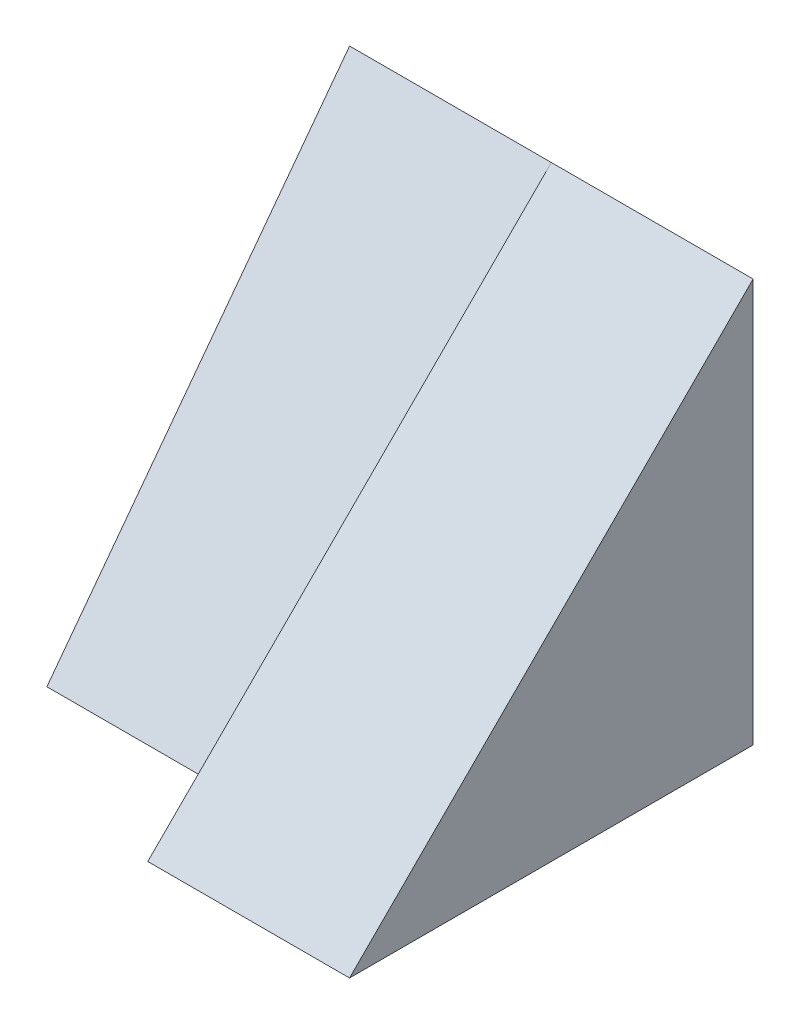
ISO-10303-21;
HEADER;
FILE_DESCRIPTION(('STEP AP214'),'2;1');
FILE_NAME('part.step','',(''),(''),'','','');
FILE_SCHEMA(('AUTOMOTIVE_DESIGN { 1 0 10303 214 1 1 1 1 }'));
ENDSEC;
DATA;
#1=APPLICATION_CONTEXT('core data for automotive mechanical design processes');
#2=APPLICATION_PROTOCOL_DEFINITION('international standard','automotive_design',2000,#1);
#3=PRODUCT_CONTEXT('',#1,'mechanical');
#4=PRODUCT('Part','Part','',(#3));
#5=PRODUCT_RELATED_PRODUCT_CATEGORY('part','',(#4));
#6=PRODUCT_DEFINITION_FORMATION('','',#4);
#7=PRODUCT_DEFINITION_CONTEXT('part definition',#1,'design');
#8=PRODUCT_DEFINITION('design','',#6,#7);
#9=PRODUCT_DEFINITION_SHAPE('','',#8);
#10=(LENGTH_UNIT() NAMED_UNIT(*) SI_UNIT(.MILLI.,.METRE.));
#11=(NAMED_UNIT(*) PLANE_ANGLE_UNIT() SI_UNIT($,.RADIAN.));
#12=(NAMED_UNIT(*) SI_UNIT($,.STERADIAN.) SOLID_ANGLE_UNIT());
#13=UNCERTAINTY_MEASURE_WITH_UNIT(LENGTH_MEASURE(1.E-05),#10,'distance_accuracy_value','');
#14=(GEOMETRIC_REPRESENTATION_CONTEXT(3) GLOBAL_UNCERTAINTY_ASSIGNED_CONTEXT((#13)) GLOBAL_UNIT_ASSIGNED_CONTEXT((#10,
#11,#12)) REPRESENTATION_CONTEXT('',''));
#15=CARTESIAN_POINT('',(0.,0.,0.));
#16=DIRECTION('',(0.,0.,1.));
#17=DIRECTION('',(1.,0.,0.));
#18=AXIS2_PLACEMENT_3D('',#15,#16,#17);
#19=CARTESIAN_POINT('',(2.,0.,0.));
#20=DIRECTION('',(0.,1.,0.));
#21=DIRECTION('',(0.,0.,1.));
#22=AXIS2_PLACEMENT_3D('',#19,#20,#21);
#23=PLANE('',#22);
#24=DIRECTION('',(0.,0.,-1.));
#25=VECTOR('',#24,1.);
#26=CARTESIAN_POINT('',(0.,0.,0.));
#27=LINE('',#26,#25);
#28=CARTESIAN_POINT('',(0.,0.,0.));
#29=VERTEX_POINT('',#28);
#30=CARTESIAN_POINT('',(0.,0.,-1.));
#31=VERTEX_POINT('',#30);
#32=EDGE_CURVE('E85',#29,#31,#27,.T.);
#33=ORIENTED_EDGE('',*,*,#32,.T.);
#34=DIRECTION('',(1.,0.,0.));
#35=VECTOR('',#34,1.);
#36=CARTESIAN_POINT('',(-2.,0.,-1.));
#37=LINE('',#36,#35);
#38=CARTESIAN_POINT('',(-2.,0.,-1.));
#39=VERTEX_POINT('',#38);
#40=EDGE_CURVE('E97',#39,#31,#37,.T.);
#41=ORIENTED_EDGE('',*,*,#40,.F.);
#42=DIRECTION('',(0.,0.,1.));
#43=VECTOR('',#42,1.);
#44=CARTESIAN_POINT('',(-2.,0.,-4.));
#45=LINE('',#44,#43);
#46=CARTESIAN_POINT('',(-2.,0.,-4.));
#47=VERTEX_POINT('',#46);
#48=EDGE_CURVE('E88',#47,#39,#45,.T.);
#49=ORIENTED_EDGE('',*,*,#48,.F.);
#50=DIRECTION('',(-1.,0.,0.));
#51=VECTOR('',#50,1.);
#52=CARTESIAN_POINT('',(2.,0.,-4.));
#53=LINE('',#52,#51);
#54=CARTESIAN_POINT('',(2.,0.,-4.));
#55=VERTEX_POINT('',#54);
#56=EDGE_CURVE('E41',#55,#47,#53,.T.);
#57=ORIENTED_EDGE('',*,*,#56,.F.);
#58=DIRECTION('',(0.,0.,-1.));
#59=VECTOR('',#58,1.);
#60=CARTESIAN_POINT('',(2.,0.,0.));
#61=LINE('',#60,#59);
#62=CARTESIAN_POINT('',(2.,0.,0.));
#63=VERTEX_POINT('',#62);
#64=EDGE_CURVE('E49',#63,#55,#61,.T.);
#65=ORIENTED_EDGE('',*,*,#64,.F.);
#66=DIRECTION('',(-1.,0.,0.));
#67=VECTOR('',#66,1.);
#68=CARTESIAN_POINT('',(2.,0.,0.));
#69=LINE('',#68,#67);
#70=EDGE_CURVE('E11',#63,#29,#69,.T.);
#71=ORIENTED_EDGE('',*,*,#70,.T.);
#72=EDGE_LOOP('',(#33,#41,#49,#57,#65,#71));
#73=FACE_BOUND('',#72,.T.);
#74=ADVANCED_FACE('F33',(#73),#23,.F.);
#75=CARTESIAN_POINT('',(2.,0.,-4.));
#76=DIRECTION('',(0.,0.,1.));
#77=DIRECTION('',(1.,0.,0.));
#78=AXIS2_PLACEMENT_3D('',#75,#76,#77);
#79=PLANE('',#78);
#80=ORIENTED_EDGE('',*,*,#56,.T.);
#81=DIRECTION('',(0.,-1.,0.));
#82=VECTOR('',#81,1.);
#83=CARTESIAN_POINT('',(-2.,4.,-4.));
#84=LINE('',#83,#82);
#85=CARTESIAN_POINT('',(-2.,4.,-4.));
#86=VERTEX_POINT('',#85);
#87=EDGE_CURVE('E104',#86,#47,#84,.T.);
#88=ORIENTED_EDGE('',*,*,#87,.F.);
#89=DIRECTION('',(-1.,0.,0.));
#90=VECTOR('',#89,1.);
#91=CARTESIAN_POINT('',(2.,4.,-4.));
#92=LINE('',#91,#90);
#93=CARTESIAN_POINT('',(0.,4.,-4.));
#94=VERTEX_POINT('',#93);
#95=EDGE_CURVE('E94',#94,#86,#92,.T.);
#96=ORIENTED_EDGE('',*,*,#95,.F.);
#97=CARTESIAN_POINT('',(2.,4.,-4.));
#98=VERTEX_POINT('',#97);
#99=EDGE_CURVE('E100',#98,#94,#92,.T.);
#100=ORIENTED_EDGE('',*,*,#99,.F.);
#101=DIRECTION('',(0.,1.,0.));
#102=VECTOR('',#101,1.);
#103=CARTESIAN_POINT('',(2.,0.,-4.));
#104=LINE('',#103,#102);
#105=EDGE_CURVE('E105',#55,#98,#104,.T.);
#106=ORIENTED_EDGE('',*,*,#105,.F.);
#107=EDGE_LOOP('',(#80,#88,#96,#100,#106));
#108=FACE_BOUND('',#107,.T.);
#109=ADVANCED_FACE('F103',(#108),#79,.F.);
#110=CARTESIAN_POINT('',(2.,0.,0.));
#111=DIRECTION('',(-1.,0.,0.));
#112=DIRECTION('',(0.,0.,1.));
#113=AXIS2_PLACEMENT_3D('',#110,#111,#112);
#114=PLANE('',#113);
#115=ORIENTED_EDGE('',*,*,#105,.T.);
#116=DIRECTION('',(0.,0.707106781186548,-0.707106781186548));
#117=VECTOR('',#116,1.);
#118=CARTESIAN_POINT('',(2.,0.,0.));
#119=LINE('',#118,#117);
#120=EDGE_CURVE('E89',#63,#98,#119,.T.);
#121=ORIENTED_EDGE('',*,*,#120,.F.);
#122=ORIENTED_EDGE('',*,*,#64,.T.);
#123=EDGE_LOOP('',(#115,#121,#122));
#124=FACE_BOUND('',#123,.T.);
#125=ADVANCED_FACE('F124',(#124),#114,.F.);
#126=CARTESIAN_POINT('',(0.,0.,0.));
#127=DIRECTION('',(-1.,0.,0.));
#128=DIRECTION('',(0.,0.,1.));
#129=AXIS2_PLACEMENT_3D('',#126,#127,#128);
#130=PLANE('',#129);
#131=DIRECTION('',(0.,0.707106781186548,-0.707106781186548));
#132=VECTOR('',#131,1.);
#133=CARTESIAN_POINT('',(0.,0.,0.));
#134=LINE('',#133,#132);
#135=EDGE_CURVE('E80',#29,#94,#134,.T.);
#136=ORIENTED_EDGE('',*,*,#135,.T.);
#137=DIRECTION('',(0.,-0.8,0.6));
#138=VECTOR('',#137,1.);
#139=CARTESIAN_POINT('',(0.,0.,-1.));
#140=LINE('',#139,#138);
#141=EDGE_CURVE('E83',#94,#31,#140,.T.);
#142=ORIENTED_EDGE('',*,*,#141,.T.);
#143=ORIENTED_EDGE('',*,*,#32,.F.);
#144=EDGE_LOOP('',(#136,#142,#143));
#145=FACE_BOUND('',#144,.T.);
#146=ADVANCED_FACE('F82',(#145),#130,.T.);
#147=CARTESIAN_POINT('',(-2.,0.,0.));
#148=DIRECTION('',(-1.,0.,0.));
#149=DIRECTION('',(0.,0.,1.));
#150=AXIS2_PLACEMENT_3D('',#147,#148,#149);
#151=PLANE('',#150);
#152=DIRECTION('',(0.,-0.8,0.6));
#153=VECTOR('',#152,1.);
#154=CARTESIAN_POINT('',(-2.,0.,-1.));
#155=LINE('',#154,#153);
#156=EDGE_CURVE('E98',#86,#39,#155,.T.);
#157=ORIENTED_EDGE('',*,*,#156,.F.);
#158=ORIENTED_EDGE('',*,*,#87,.T.);
#159=ORIENTED_EDGE('',*,*,#48,.T.);
#160=EDGE_LOOP('',(#157,#158,#159));
#161=FACE_BOUND('',#160,.T.);
#162=ADVANCED_FACE('F122',(#161),#151,.T.);
#163=CARTESIAN_POINT('',(0.,0.,0.));
#164=DIRECTION('',(0.,-0.707106781186547,-0.707106781186547));
#165=DIRECTION('',(0.,0.707106781186548,-0.707106781186548));
#166=AXIS2_PLACEMENT_3D('',#163,#164,#165);
#167=PLANE('',#166);
#168=ORIENTED_EDGE('',*,*,#120,.T.);
#169=ORIENTED_EDGE('',*,*,#99,.T.);
#170=ORIENTED_EDGE('',*,*,#135,.F.);
#171=ORIENTED_EDGE('',*,*,#70,.F.);
#172=EDGE_LOOP('',(#168,#169,#170,#171));
#173=FACE_BOUND('',#172,.T.);
#174=ADVANCED_FACE('F101',(#173),#167,.F.);
#175=CARTESIAN_POINT('',(0.,0.,-1.));
#176=DIRECTION('',(0.,-0.6,-0.8));
#177=DIRECTION('',(0.,0.8,-0.6));
#178=AXIS2_PLACEMENT_3D('',#175,#176,#177);
#179=PLANE('',#178);
#180=ORIENTED_EDGE('',*,*,#156,.T.);
#181=ORIENTED_EDGE('',*,*,#40,.T.);
#182=ORIENTED_EDGE('',*,*,#141,.F.);
#183=ORIENTED_EDGE('',*,*,#95,.T.);
#184=EDGE_LOOP('',(#180,#181,#182,#183));
#185=FACE_BOUND('',#184,.T.);
#186=ADVANCED_FACE('F92',(#185),#179,.F.);
#187=CLOSED_SHELL('',(#74,#109,#125,#146,#162,#174,#186));
#188=MANIFOLD_SOLID_BREP('B2',#187);
#189=ADVANCED_BREP_SHAPE_REPRESENTATION('',(#18,#188),#14);
#190=SHAPE_DEFINITION_REPRESENTATION(#9,#189);
ENDSEC;
END-ISO-10303-21;
